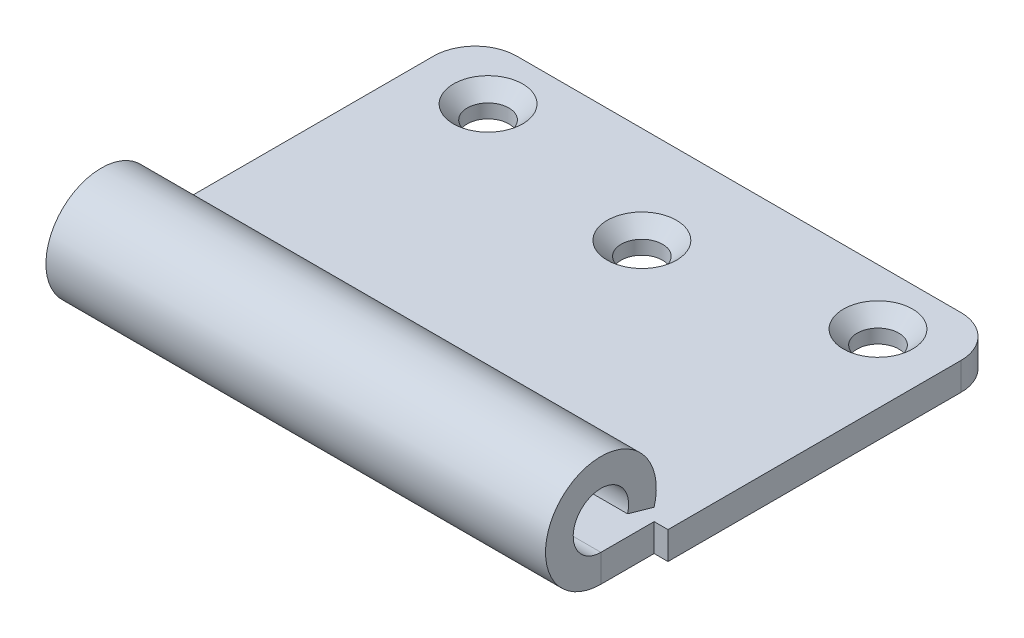
ISO-10303-21;
HEADER;
FILE_DESCRIPTION(('STEP AP214'),'2;1');
FILE_NAME('part.step','',(''),(''),'','','');
FILE_SCHEMA(('AUTOMOTIVE_DESIGN { 1 0 10303 214 1 1 1 1 }'));
ENDSEC;
DATA;
#1=APPLICATION_CONTEXT('core data for automotive mechanical design processes');
#2=APPLICATION_PROTOCOL_DEFINITION('international standard','automotive_design',2000,#1);
#3=PRODUCT_CONTEXT('',#1,'mechanical');
#4=PRODUCT('Part','Part','',(#3));
#5=PRODUCT_RELATED_PRODUCT_CATEGORY('part','',(#4));
#6=PRODUCT_DEFINITION_FORMATION('','',#4);
#7=PRODUCT_DEFINITION_CONTEXT('part definition',#1,'design');
#8=PRODUCT_DEFINITION('design','',#6,#7);
#9=PRODUCT_DEFINITION_SHAPE('','',#8);
#10=(LENGTH_UNIT() NAMED_UNIT(*) SI_UNIT(.MILLI.,.METRE.));
#11=(NAMED_UNIT(*) PLANE_ANGLE_UNIT() SI_UNIT($,.RADIAN.));
#12=(NAMED_UNIT(*) SI_UNIT($,.STERADIAN.) SOLID_ANGLE_UNIT());
#13=UNCERTAINTY_MEASURE_WITH_UNIT(LENGTH_MEASURE(1.E-05),#10,'distance_accuracy_value','');
#14=(GEOMETRIC_REPRESENTATION_CONTEXT(3) GLOBAL_UNCERTAINTY_ASSIGNED_CONTEXT((#13)) GLOBAL_UNIT_ASSIGNED_CONTEXT((#10,
#11,#12)) REPRESENTATION_CONTEXT('',''));
#15=CARTESIAN_POINT('',(0.,0.,0.));
#16=DIRECTION('',(0.,0.,1.));
#17=DIRECTION('',(1.,0.,0.));
#18=AXIS2_PLACEMENT_3D('',#15,#16,#17);
#19=CARTESIAN_POINT('',(3.65617324596296,3.44872528836599,27.6968267927588));
#20=DIRECTION('',(0.,0.961261695938317,-0.275637355817006));
#21=DIRECTION('',(1.,0.,0.));
#22=AXIS2_PLACEMENT_3D('',#19,#20,#21);
#23=PLANE('',#22);
#24=DIRECTION('',(1.,0.,0.));
#25=VECTOR('',#24,1.);
#26=CARTESIAN_POINT('',(22.696173245963,3.44872528836599,27.6968267927588));
#27=LINE('',#26,#25);
#28=CARTESIAN_POINT('',(-14.383826754037,3.44872528836599,27.6968267927588));
#29=VERTEX_POINT('',#28);
#30=CARTESIAN_POINT('',(21.696173245963,3.44872528836599,27.6968267927588));
#31=VERTEX_POINT('',#30);
#32=EDGE_CURVE('E144',#29,#31,#27,.T.);
#33=ORIENTED_EDGE('',*,*,#32,.F.);
#34=DIRECTION('',(0.,0.275637355817006,0.961261695938317));
#35=VECTOR('',#34,1.);
#36=CARTESIAN_POINT('',(-14.383826754037,3.44872528836599,27.6968267927588));
#37=LINE('',#36,#35);
#38=CARTESIAN_POINT('',(-14.383826754037,2.89745057673197,25.7743034008822));
#39=VERTEX_POINT('',#38);
#40=EDGE_CURVE('E130',#29,#39,#37,.F.);
#41=ORIENTED_EDGE('',*,*,#40,.T.);
#42=DIRECTION('',(1.,0.,0.));
#43=VECTOR('',#42,1.);
#44=CARTESIAN_POINT('',(22.696173245963,2.89745057673197,25.7743034008822));
#45=LINE('',#44,#43);
#46=CARTESIAN_POINT('',(21.696173245963,2.89745057673197,25.7743034008822));
#47=VERTEX_POINT('',#46);
#48=EDGE_CURVE('E142',#39,#47,#45,.T.);
#49=ORIENTED_EDGE('',*,*,#48,.T.);
#50=DIRECTION('',(0.,-0.275637355817006,-0.961261695938317));
#51=VECTOR('',#50,1.);
#52=CARTESIAN_POINT('',(21.696173245963,3.44872528836599,27.6968267927588));
#53=LINE('',#52,#51);
#54=EDGE_CURVE('E238',#47,#31,#53,.F.);
#55=ORIENTED_EDGE('',*,*,#54,.T.);
#56=EDGE_LOOP('',(#33,#41,#49,#55));
#57=FACE_BOUND('',#56,.T.);
#58=ADVANCED_FACE('F40',(#57),#23,.F.);
#59=CARTESIAN_POINT('',(22.696173245963,4.,29.6193501846355));
#60=DIRECTION('',(1.,0.,0.));
#61=DIRECTION('',(0.,-0.275637355817006,-0.961261695938317));
#62=AXIS2_PLACEMENT_3D('',#59,#60,#61);
#63=CYLINDRICAL_SURFACE('',#62,4.);
#64=ORIENTED_EDGE('',*,*,#48,.F.);
#65=CARTESIAN_POINT('',(-14.383826754037,4.,29.6193501846355));
#66=DIRECTION('',(-1.,0.,0.));
#67=DIRECTION('',(0.,0.,1.));
#68=AXIS2_PLACEMENT_3D('',#65,#66,#67);
#69=CIRCLE('',#68,4.);
#70=CARTESIAN_POINT('',(-14.383826754037,0.,29.6193501846355));
#71=VERTEX_POINT('',#70);
#72=EDGE_CURVE('E127',#71,#39,#69,.T.);
#73=ORIENTED_EDGE('',*,*,#72,.F.);
#74=DIRECTION('',(1.,0.,0.));
#75=VECTOR('',#74,1.);
#76=CARTESIAN_POINT('',(-15.383826754037,0.,29.6193501846355));
#77=LINE('',#76,#75);
#78=CARTESIAN_POINT('',(21.696173245963,0.,29.6193501846355));
#79=VERTEX_POINT('',#78);
#80=EDGE_CURVE('E159',#71,#79,#77,.T.);
#81=ORIENTED_EDGE('',*,*,#80,.T.);
#82=CARTESIAN_POINT('',(21.696173245963,4.,29.6193501846355));
#83=DIRECTION('',(1.,0.,0.));
#84=DIRECTION('',(0.,0.,-1.));
#85=AXIS2_PLACEMENT_3D('',#82,#83,#84);
#86=CIRCLE('',#85,4.);
#87=EDGE_CURVE('E150',#47,#79,#86,.T.);
#88=ORIENTED_EDGE('',*,*,#87,.F.);
#89=EDGE_LOOP('',(#64,#73,#81,#88));
#90=FACE_BOUND('',#89,.T.);
#91=ADVANCED_FACE('F148',(#90),#63,.T.);
#92=CARTESIAN_POINT('',(22.696173245963,4.,29.6193501846355));
#93=DIRECTION('',(1.,0.,0.));
#94=DIRECTION('',(0.,-0.275637355817006,-0.961261695938317));
#95=AXIS2_PLACEMENT_3D('',#92,#93,#94);
#96=CYLINDRICAL_SURFACE('',#95,2.);
#97=CARTESIAN_POINT('',(-14.383826754037,4.,29.6193501846355));
#98=DIRECTION('',(-1.,0.,0.));
#99=DIRECTION('',(0.,0.,1.));
#100=AXIS2_PLACEMENT_3D('',#97,#98,#99);
#101=CIRCLE('',#100,2.);
#102=CARTESIAN_POINT('',(-14.383826754037,2.,29.6193501846355));
#103=VERTEX_POINT('',#102);
#104=EDGE_CURVE('E55',#29,#103,#101,.F.);
#105=ORIENTED_EDGE('',*,*,#104,.F.);
#106=ORIENTED_EDGE('',*,*,#32,.T.);
#107=CARTESIAN_POINT('',(21.696173245963,4.,29.6193501846355));
#108=DIRECTION('',(1.,0.,0.));
#109=DIRECTION('',(0.,0.,-1.));
#110=AXIS2_PLACEMENT_3D('',#107,#108,#109);
#111=CIRCLE('',#110,2.);
#112=CARTESIAN_POINT('',(21.696173245963,2.,29.6193501846355));
#113=VERTEX_POINT('',#112);
#114=EDGE_CURVE('E224',#113,#31,#111,.F.);
#115=ORIENTED_EDGE('',*,*,#114,.F.);
#116=DIRECTION('',(1.,0.,0.));
#117=VECTOR('',#116,1.);
#118=CARTESIAN_POINT('',(19.696173245963,2.,29.6193501846355));
#119=LINE('',#118,#117);
#120=EDGE_CURVE('E61',#103,#113,#119,.T.);
#121=ORIENTED_EDGE('',*,*,#120,.F.);
#122=EDGE_LOOP('',(#105,#106,#115,#121));
#123=FACE_BOUND('',#122,.T.);
#124=ADVANCED_FACE('F306',(#123),#96,.F.);
#125=CARTESIAN_POINT('',(21.696173245963,4.,29.6193501846355));
#126=DIRECTION('',(1.,0.,0.));
#127=DIRECTION('',(0.,0.,-1.));
#128=AXIS2_PLACEMENT_3D('',#125,#126,#127);
#129=PLANE('',#128);
#130=DIRECTION('',(0.,0.,-1.));
#131=VECTOR('',#130,1.);
#132=CARTESIAN_POINT('',(21.6961732459629,2.,4.61935018463548));
#133=LINE('',#132,#131);
#134=CARTESIAN_POINT('',(21.696173245963,2.,25.7743034008822));
#135=VERTEX_POINT('',#134);
#136=EDGE_CURVE('E234',#113,#135,#133,.T.);
#137=ORIENTED_EDGE('',*,*,#136,.F.);
#138=DIRECTION('',(0.,-1.,0.));
#139=VECTOR('',#138,1.);
#140=CARTESIAN_POINT('',(21.696173245963,2.,29.6193501846355));
#141=LINE('',#140,#139);
#142=EDGE_CURVE('E48',#113,#79,#141,.T.);
#143=ORIENTED_EDGE('',*,*,#142,.T.);
#144=DIRECTION('',(0.,0.,-1.));
#145=VECTOR('',#144,1.);
#146=CARTESIAN_POINT('',(21.696173245963,0.,25.7743034008822));
#147=LINE('',#146,#145);
#148=CARTESIAN_POINT('',(21.696173245963,0.,25.7743034008822));
#149=VERTEX_POINT('',#148);
#150=EDGE_CURVE('E232',#79,#149,#147,.T.);
#151=ORIENTED_EDGE('',*,*,#150,.T.);
#152=DIRECTION('',(0.,1.,0.));
#153=VECTOR('',#152,1.);
#154=CARTESIAN_POINT('',(21.696173245963,2.89745057673197,25.7743034008822));
#155=LINE('',#154,#153);
#156=EDGE_CURVE('E246',#149,#135,#155,.T.);
#157=ORIENTED_EDGE('',*,*,#156,.T.);
#158=EDGE_LOOP('',(#137,#143,#151,#157));
#159=FACE_BOUND('',#158,.T.);
#160=ADVANCED_FACE('F229',(#159),#129,.T.);
#161=CARTESIAN_POINT('',(-12.383826754037,0.,4.61935018463549));
#162=DIRECTION('',(0.,1.,0.));
#163=DIRECTION('',(0.,0.,1.));
#164=AXIS2_PLACEMENT_3D('',#161,#162,#163);
#165=CYLINDRICAL_SURFACE('',#164,3.);
#166=DIRECTION('',(0.,-1.,0.));
#167=VECTOR('',#166,1.);
#168=CARTESIAN_POINT('',(-15.383826754037,0.,4.61935018463551));
#169=LINE('',#168,#167);
#170=CARTESIAN_POINT('',(-15.383826754037,2.,4.61935018463551));
#171=VERTEX_POINT('',#170);
#172=CARTESIAN_POINT('',(-15.383826754037,0.,4.61935018463551));
#173=VERTEX_POINT('',#172);
#174=EDGE_CURVE('E204',#171,#173,#169,.T.);
#175=ORIENTED_EDGE('',*,*,#174,.F.);
#176=CARTESIAN_POINT('',(-12.383826754037,2.,4.61935018463549));
#177=DIRECTION('',(0.,1.,0.));
#178=DIRECTION('',(0.,0.,1.));
#179=AXIS2_PLACEMENT_3D('',#176,#177,#178);
#180=CIRCLE('',#179,3.);
#181=CARTESIAN_POINT('',(-12.383826754037,2.,1.61935018463549));
#182=VERTEX_POINT('',#181);
#183=EDGE_CURVE('E193',#182,#171,#180,.T.);
#184=ORIENTED_EDGE('',*,*,#183,.F.);
#185=DIRECTION('',(0.,-1.,0.));
#186=VECTOR('',#185,1.);
#187=CARTESIAN_POINT('',(-12.383826754037,0.,1.61935018463549));
#188=LINE('',#187,#186);
#189=CARTESIAN_POINT('',(-12.383826754037,0.,1.61935018463549));
#190=VERTEX_POINT('',#189);
#191=EDGE_CURVE('E202',#182,#190,#188,.T.);
#192=ORIENTED_EDGE('',*,*,#191,.T.);
#193=CARTESIAN_POINT('',(-12.383826754037,0.,4.61935018463549));
#194=DIRECTION('',(0.,1.,0.));
#195=DIRECTION('',(0.,0.,1.));
#196=AXIS2_PLACEMENT_3D('',#193,#194,#195);
#197=CIRCLE('',#196,3.);
#198=EDGE_CURVE('E165',#190,#173,#197,.T.);
#199=ORIENTED_EDGE('',*,*,#198,.T.);
#200=EDGE_LOOP('',(#175,#184,#192,#199));
#201=FACE_BOUND('',#200,.T.);
#202=ADVANCED_FACE('F274',(#201),#165,.T.);
#203=CARTESIAN_POINT('',(-12.383826754037,0.,1.61935018463549));
#204=DIRECTION('',(0.,0.,-1.));
#205=DIRECTION('',(-1.,0.,0.));
#206=AXIS2_PLACEMENT_3D('',#203,#204,#205);
#207=PLANE('',#206);
#208=ORIENTED_EDGE('',*,*,#191,.F.);
#209=DIRECTION('',(1.,0.,0.));
#210=VECTOR('',#209,1.);
#211=CARTESIAN_POINT('',(19.696173245963,2.,1.61935018463548));
#212=LINE('',#211,#210);
#213=CARTESIAN_POINT('',(19.6961732459629,2.,1.61935018463548));
#214=VERTEX_POINT('',#213);
#215=EDGE_CURVE('E190',#214,#182,#212,.F.);
#216=ORIENTED_EDGE('',*,*,#215,.F.);
#217=DIRECTION('',(0.,-1.,0.));
#218=VECTOR('',#217,1.);
#219=CARTESIAN_POINT('',(19.6961732459629,0.,1.61935018463548));
#220=LINE('',#219,#218);
#221=CARTESIAN_POINT('',(19.6961732459629,0.,1.61935018463548));
#222=VERTEX_POINT('',#221);
#223=EDGE_CURVE('E200',#214,#222,#220,.T.);
#224=ORIENTED_EDGE('',*,*,#223,.T.);
#225=DIRECTION('',(-1.,0.,0.));
#226=VECTOR('',#225,1.);
#227=CARTESIAN_POINT('',(-12.383826754037,0.,1.61935018463549));
#228=LINE('',#227,#226);
#229=EDGE_CURVE('E168',#222,#190,#228,.T.);
#230=ORIENTED_EDGE('',*,*,#229,.T.);
#231=EDGE_LOOP('',(#208,#216,#224,#230));
#232=FACE_BOUND('',#231,.T.);
#233=ADVANCED_FACE('F270',(#232),#207,.T.);
#234=CARTESIAN_POINT('',(19.696173245963,0.,4.61935018463548));
#235=DIRECTION('',(0.,1.,0.));
#236=DIRECTION('',(0.,0.,1.));
#237=AXIS2_PLACEMENT_3D('',#234,#235,#236);
#238=CYLINDRICAL_SURFACE('',#237,3.);
#239=ORIENTED_EDGE('',*,*,#223,.F.);
#240=CARTESIAN_POINT('',(19.696173245963,2.,4.61935018463548));
#241=DIRECTION('',(0.,1.,0.));
#242=DIRECTION('',(0.,0.,1.));
#243=AXIS2_PLACEMENT_3D('',#240,#241,#242);
#244=CIRCLE('',#243,3.);
#245=CARTESIAN_POINT('',(22.696173245963,2.,4.6193501846355));
#246=VERTEX_POINT('',#245);
#247=EDGE_CURVE('E187',#246,#214,#244,.T.);
#248=ORIENTED_EDGE('',*,*,#247,.F.);
#249=DIRECTION('',(0.,-1.,0.));
#250=VECTOR('',#249,1.);
#251=CARTESIAN_POINT('',(22.696173245963,0.,4.6193501846355));
#252=LINE('',#251,#250);
#253=CARTESIAN_POINT('',(22.696173245963,0.,4.6193501846355));
#254=VERTEX_POINT('',#253);
#255=EDGE_CURVE('E184',#246,#254,#252,.T.);
#256=ORIENTED_EDGE('',*,*,#255,.T.);
#257=CARTESIAN_POINT('',(19.696173245963,0.,4.61935018463548));
#258=DIRECTION('',(0.,1.,0.));
#259=DIRECTION('',(0.,0.,1.));
#260=AXIS2_PLACEMENT_3D('',#257,#258,#259);
#261=CIRCLE('',#260,3.);
#262=EDGE_CURVE('E171',#254,#222,#261,.T.);
#263=ORIENTED_EDGE('',*,*,#262,.T.);
#264=EDGE_LOOP('',(#239,#248,#256,#263));
#265=FACE_BOUND('',#264,.T.);
#266=ADVANCED_FACE('F266',(#265),#238,.T.);
#267=CARTESIAN_POINT('',(22.696173245963,0.,4.6193501846355));
#268=DIRECTION('',(1.,0.,0.));
#269=DIRECTION('',(0.,0.,-1.));
#270=AXIS2_PLACEMENT_3D('',#267,#268,#269);
#271=PLANE('',#270);
#272=DIRECTION('',(0.,1.,0.));
#273=VECTOR('',#272,1.);
#274=CARTESIAN_POINT('',(22.696173245963,2.89745057673197,25.7743034008822));
#275=LINE('',#274,#273);
#276=CARTESIAN_POINT('',(22.696173245963,0.,25.7743034008822));
#277=VERTEX_POINT('',#276);
#278=CARTESIAN_POINT('',(22.696173245963,2.,25.7743034008822));
#279=VERTEX_POINT('',#278);
#280=EDGE_CURVE('E145',#277,#279,#275,.T.);
#281=ORIENTED_EDGE('',*,*,#280,.F.);
#282=DIRECTION('',(0.,0.,-1.));
#283=VECTOR('',#282,1.);
#284=CARTESIAN_POINT('',(22.696173245963,0.,4.6193501846355));
#285=LINE('',#284,#283);
#286=EDGE_CURVE('E174',#277,#254,#285,.T.);
#287=ORIENTED_EDGE('',*,*,#286,.T.);
#288=ORIENTED_EDGE('',*,*,#255,.F.);
#289=DIRECTION('',(0.,0.,1.));
#290=VECTOR('',#289,1.);
#291=CARTESIAN_POINT('',(22.696173245963,2.,4.61935018463548));
#292=LINE('',#291,#290);
#293=EDGE_CURVE('E162',#279,#246,#292,.F.);
#294=ORIENTED_EDGE('',*,*,#293,.F.);
#295=EDGE_LOOP('',(#281,#287,#288,#294));
#296=FACE_BOUND('',#295,.T.);
#297=ADVANCED_FACE('F262',(#296),#271,.T.);
#298=CARTESIAN_POINT('',(-15.383826754037,0.,12.1160603566887));
#299=DIRECTION('',(-1.,0.,0.));
#300=DIRECTION('',(0.,0.,1.));
#301=AXIS2_PLACEMENT_3D('',#298,#299,#300);
#302=PLANE('',#301);
#303=DIRECTION('',(0.,-1.,0.));
#304=VECTOR('',#303,1.);
#305=CARTESIAN_POINT('',(-15.383826754037,2.89745057673197,25.7743034008822));
#306=LINE('',#305,#304);
#307=CARTESIAN_POINT('',(-15.383826754037,2.,25.7743034008822));
#308=VERTEX_POINT('',#307);
#309=CARTESIAN_POINT('',(-15.383826754037,0.,25.7743034008822));
#310=VERTEX_POINT('',#309);
#311=EDGE_CURVE('E137',#308,#310,#306,.T.);
#312=ORIENTED_EDGE('',*,*,#311,.F.);
#313=DIRECTION('',(0.,0.,1.));
#314=VECTOR('',#313,1.);
#315=CARTESIAN_POINT('',(-15.383826754037,2.,4.61935018463548));
#316=LINE('',#315,#314);
#317=EDGE_CURVE('E152',#171,#308,#316,.T.);
#318=ORIENTED_EDGE('',*,*,#317,.F.);
#319=ORIENTED_EDGE('',*,*,#174,.T.);
#320=DIRECTION('',(0.,0.,1.));
#321=VECTOR('',#320,1.);
#322=CARTESIAN_POINT('',(-15.383826754037,0.,12.1160603566887));
#323=LINE('',#322,#321);
#324=EDGE_CURVE('E161',#173,#310,#323,.T.);
#325=ORIENTED_EDGE('',*,*,#324,.T.);
#326=EDGE_LOOP('',(#312,#318,#319,#325));
#327=FACE_BOUND('',#326,.T.);
#328=ADVANCED_FACE('F281',(#327),#302,.T.);
#329=CARTESIAN_POINT('',(17.7374344676116,0.,5.64654971374041));
#330=DIRECTION('',(0.,1.,0.));
#331=DIRECTION('',(0.,0.,1.));
#332=AXIS2_PLACEMENT_3D('',#329,#330,#331);
#333=CYLINDRICAL_SURFACE('',#332,1.5);
#334=CARTESIAN_POINT('',(17.7374344676116,1.00000000000001,5.64654971374041));
#335=DIRECTION('',(0.,1.,0.));
#336=DIRECTION('',(0.,0.,1.));
#337=AXIS2_PLACEMENT_3D('',#334,#335,#336);
#338=CIRCLE('',#337,1.5);
#339=CARTESIAN_POINT('',(17.7374344676116,1.00000000000001,7.14654971374041));
#340=VERTEX_POINT('',#339);
#341=EDGE_CURVE('E206',#340,#340,#338,.T.);
#342=ORIENTED_EDGE('',*,*,#341,.T.);
#343=EDGE_LOOP('',(#342));
#344=FACE_BOUND('',#343,.T.);
#345=CARTESIAN_POINT('',(17.7374344676116,0.,5.64654971374041));
#346=DIRECTION('',(0.,1.,0.));
#347=DIRECTION('',(0.,0.,-1.));
#348=AXIS2_PLACEMENT_3D('',#345,#346,#347);
#349=CIRCLE('',#348,1.5);
#350=CARTESIAN_POINT('',(17.7374344676116,0.,4.14654971374041));
#351=VERTEX_POINT('',#350);
#352=EDGE_CURVE('E176',#351,#351,#349,.T.);
#353=ORIENTED_EDGE('',*,*,#352,.F.);
#354=EDGE_LOOP('',(#353));
#355=FACE_BOUND('',#354,.T.);
#356=ADVANCED_FACE('F326',(#344,#355),#333,.F.);
#357=CARTESIAN_POINT('',(3.65617324596296,0.,8.61935018463548));
#358=DIRECTION('',(0.,1.,0.));
#359=DIRECTION('',(0.,0.,1.));
#360=AXIS2_PLACEMENT_3D('',#357,#358,#359);
#361=CYLINDRICAL_SURFACE('',#360,1.5);
#362=CARTESIAN_POINT('',(3.65617324596296,1.00000000000001,8.61935018463548));
#363=DIRECTION('',(0.,1.,0.));
#364=DIRECTION('',(0.,0.,1.));
#365=AXIS2_PLACEMENT_3D('',#362,#363,#364);
#366=CIRCLE('',#365,1.5);
#367=CARTESIAN_POINT('',(3.65617324596296,1.00000000000001,10.1193501846355));
#368=VERTEX_POINT('',#367);
#369=EDGE_CURVE('E218',#368,#368,#366,.T.);
#370=ORIENTED_EDGE('',*,*,#369,.T.);
#371=EDGE_LOOP('',(#370));
#372=FACE_BOUND('',#371,.T.);
#373=CARTESIAN_POINT('',(3.65617324596296,0.,8.61935018463548));
#374=DIRECTION('',(0.,1.,0.));
#375=DIRECTION('',(0.,0.,1.));
#376=AXIS2_PLACEMENT_3D('',#373,#374,#375);
#377=CIRCLE('',#376,1.5);
#378=CARTESIAN_POINT('',(3.65617324596296,0.,10.1193501846355));
#379=VERTEX_POINT('',#378);
#380=EDGE_CURVE('E179',#379,#379,#377,.T.);
#381=ORIENTED_EDGE('',*,*,#380,.F.);
#382=EDGE_LOOP('',(#381));
#383=FACE_BOUND('',#382,.T.);
#384=ADVANCED_FACE('F329',(#372,#383),#361,.F.);
#385=CARTESIAN_POINT('',(-10.4250879756856,0.,5.64654971374041));
#386=DIRECTION('',(0.,1.,0.));
#387=DIRECTION('',(0.,0.,1.));
#388=AXIS2_PLACEMENT_3D('',#385,#386,#387);
#389=CYLINDRICAL_SURFACE('',#388,1.5);
#390=CARTESIAN_POINT('',(-10.4250879756856,1.00000000000001,5.64654971374041));
#391=DIRECTION('',(0.,1.,0.));
#392=DIRECTION('',(0.,0.,1.));
#393=AXIS2_PLACEMENT_3D('',#390,#391,#392);
#394=CIRCLE('',#393,1.5);
#395=CARTESIAN_POINT('',(-10.4250879756856,1.00000000000001,7.14654971374041));
#396=VERTEX_POINT('',#395);
#397=EDGE_CURVE('E221',#396,#396,#394,.T.);
#398=ORIENTED_EDGE('',*,*,#397,.T.);
#399=EDGE_LOOP('',(#398));
#400=FACE_BOUND('',#399,.T.);
#401=CARTESIAN_POINT('',(-10.4250879756856,0.,5.64654971374041));
#402=DIRECTION('',(0.,1.,0.));
#403=DIRECTION('',(0.,0.,1.));
#404=AXIS2_PLACEMENT_3D('',#401,#402,#403);
#405=CIRCLE('',#404,1.5);
#406=CARTESIAN_POINT('',(-10.4250879756856,0.,7.14654971374041));
#407=VERTEX_POINT('',#406);
#408=EDGE_CURVE('E182',#407,#407,#405,.T.);
#409=ORIENTED_EDGE('',*,*,#408,.F.);
#410=EDGE_LOOP('',(#409));
#411=FACE_BOUND('',#410,.T.);
#412=ADVANCED_FACE('F312',(#400,#411),#389,.F.);
#413=CARTESIAN_POINT('',(19.696173245963,0.,4.61935018463548));
#414=DIRECTION('',(0.,1.,0.));
#415=DIRECTION('',(0.,0.,1.));
#416=AXIS2_PLACEMENT_3D('',#413,#414,#415);
#417=PLANE('',#416);
#418=DIRECTION('',(0.,0.,1.));
#419=VECTOR('',#418,1.);
#420=CARTESIAN_POINT('',(-14.383826754037,0.,25.7743034008822));
#421=LINE('',#420,#419);
#422=CARTESIAN_POINT('',(-14.383826754037,0.,25.7743034008822));
#423=VERTEX_POINT('',#422);
#424=EDGE_CURVE('E132',#423,#71,#421,.T.);
#425=ORIENTED_EDGE('',*,*,#424,.F.);
#426=DIRECTION('',(-1.,0.,0.));
#427=VECTOR('',#426,1.);
#428=CARTESIAN_POINT('',(-14.383826754037,0.,25.7743034008822));
#429=LINE('',#428,#427);
#430=EDGE_CURVE('E278',#423,#310,#429,.T.);
#431=ORIENTED_EDGE('',*,*,#430,.T.);
#432=ORIENTED_EDGE('',*,*,#324,.F.);
#433=ORIENTED_EDGE('',*,*,#198,.F.);
#434=ORIENTED_EDGE('',*,*,#229,.F.);
#435=ORIENTED_EDGE('',*,*,#262,.F.);
#436=ORIENTED_EDGE('',*,*,#286,.F.);
#437=DIRECTION('',(1.,0.,0.));
#438=VECTOR('',#437,1.);
#439=CARTESIAN_POINT('',(21.696173245963,0.,25.7743034008822));
#440=LINE('',#439,#438);
#441=EDGE_CURVE('E245',#149,#277,#440,.T.);
#442=ORIENTED_EDGE('',*,*,#441,.F.);
#443=ORIENTED_EDGE('',*,*,#150,.F.);
#444=ORIENTED_EDGE('',*,*,#80,.F.);
#445=EDGE_LOOP('',(#425,#431,#432,#433,#434,#435,#436,#442,#443,#444));
#446=FACE_BOUND('',#445,.T.);
#447=ORIENTED_EDGE('',*,*,#352,.T.);
#448=EDGE_LOOP('',(#447));
#449=FACE_BOUND('',#448,.T.);
#450=ORIENTED_EDGE('',*,*,#380,.T.);
#451=EDGE_LOOP('',(#450));
#452=FACE_BOUND('',#451,.T.);
#453=ORIENTED_EDGE('',*,*,#408,.T.);
#454=EDGE_LOOP('',(#453));
#455=FACE_BOUND('',#454,.T.);
#456=ADVANCED_FACE('F242',(#446,#449,#452,#455),#417,.F.);
#457=CARTESIAN_POINT('',(19.696173245963,2.,4.61935018463548));
#458=DIRECTION('',(0.,1.,0.));
#459=DIRECTION('',(0.,0.,1.));
#460=AXIS2_PLACEMENT_3D('',#457,#458,#459);
#461=PLANE('',#460);
#462=DIRECTION('',(-1.,0.,0.));
#463=VECTOR('',#462,1.);
#464=CARTESIAN_POINT('',(19.696173245963,2.,25.7743034008822));
#465=LINE('',#464,#463);
#466=CARTESIAN_POINT('',(-14.383826754037,2.,25.7743034008822));
#467=VERTEX_POINT('',#466);
#468=EDGE_CURVE('E283',#467,#308,#465,.T.);
#469=ORIENTED_EDGE('',*,*,#468,.F.);
#470=DIRECTION('',(0.,0.,1.));
#471=VECTOR('',#470,1.);
#472=CARTESIAN_POINT('',(-14.383826754037,2.,4.61935018463549));
#473=LINE('',#472,#471);
#474=EDGE_CURVE('E12',#467,#103,#473,.T.);
#475=ORIENTED_EDGE('',*,*,#474,.T.);
#476=ORIENTED_EDGE('',*,*,#120,.T.);
#477=ORIENTED_EDGE('',*,*,#136,.T.);
#478=DIRECTION('',(-1.,0.,0.));
#479=VECTOR('',#478,1.);
#480=CARTESIAN_POINT('',(19.696173245963,2.,25.7743034008822));
#481=LINE('',#480,#479);
#482=EDGE_CURVE('E154',#279,#135,#481,.T.);
#483=ORIENTED_EDGE('',*,*,#482,.F.);
#484=ORIENTED_EDGE('',*,*,#293,.T.);
#485=ORIENTED_EDGE('',*,*,#247,.T.);
#486=ORIENTED_EDGE('',*,*,#215,.T.);
#487=ORIENTED_EDGE('',*,*,#183,.T.);
#488=ORIENTED_EDGE('',*,*,#317,.T.);
#489=EDGE_LOOP('',(#469,#475,#476,#477,#483,#484,#485,#486,#487,#488));
#490=FACE_BOUND('',#489,.T.);
#491=CARTESIAN_POINT('',(17.7374344676116,2.,5.64654971374041));
#492=DIRECTION('',(0.,1.,0.));
#493=DIRECTION('',(0.,0.,1.));
#494=AXIS2_PLACEMENT_3D('',#491,#492,#493);
#495=CIRCLE('',#494,2.49999999999999);
#496=CARTESIAN_POINT('',(17.7374344676116,2.,8.1465497137404));
#497=VERTEX_POINT('',#496);
#498=EDGE_CURVE('E215',#497,#497,#495,.F.);
#499=ORIENTED_EDGE('',*,*,#498,.T.);
#500=EDGE_LOOP('',(#499));
#501=FACE_BOUND('',#500,.T.);
#502=CARTESIAN_POINT('',(3.65617324596296,2.,8.61935018463548));
#503=DIRECTION('',(0.,1.,0.));
#504=DIRECTION('',(0.,0.,1.));
#505=AXIS2_PLACEMENT_3D('',#502,#503,#504);
#506=CIRCLE('',#505,2.49999999999999);
#507=CARTESIAN_POINT('',(3.65617324596296,2.,11.1193501846355));
#508=VERTEX_POINT('',#507);
#509=EDGE_CURVE('E212',#508,#508,#506,.F.);
#510=ORIENTED_EDGE('',*,*,#509,.T.);
#511=EDGE_LOOP('',(#510));
#512=FACE_BOUND('',#511,.T.);
#513=CARTESIAN_POINT('',(-10.4250879756856,2.,5.64654971374041));
#514=DIRECTION('',(0.,1.,0.));
#515=DIRECTION('',(0.,0.,1.));
#516=AXIS2_PLACEMENT_3D('',#513,#514,#515);
#517=CIRCLE('',#516,2.49999999999999);
#518=CARTESIAN_POINT('',(-10.4250879756856,2.,8.1465497137404));
#519=VERTEX_POINT('',#518);
#520=EDGE_CURVE('E209',#519,#519,#517,.F.);
#521=ORIENTED_EDGE('',*,*,#520,.T.);
#522=EDGE_LOOP('',(#521));
#523=FACE_BOUND('',#522,.T.);
#524=ADVANCED_FACE('F258',(#490,#501,#512,#523),#461,.T.);
#525=CARTESIAN_POINT('',(17.7374344676116,1.00000000000001,5.64654971374041));
#526=DIRECTION('',(0.,1.,0.));
#527=DIRECTION('',(0.,0.,1.));
#528=AXIS2_PLACEMENT_3D('',#525,#526,#527);
#529=CONICAL_SURFACE('',#528,1.5,0.785398163397449);
#530=ORIENTED_EDGE('',*,*,#498,.F.);
#531=EDGE_LOOP('',(#530));
#532=FACE_BOUND('',#531,.T.);
#533=ORIENTED_EDGE('',*,*,#341,.F.);
#534=EDGE_LOOP('',(#533));
#535=FACE_BOUND('',#534,.T.);
#536=ADVANCED_FACE('F315',(#532,#535),#529,.F.);
#537=CARTESIAN_POINT('',(3.65617324596296,1.00000000000001,8.61935018463548));
#538=DIRECTION('',(0.,1.,0.));
#539=DIRECTION('',(0.,0.,1.));
#540=AXIS2_PLACEMENT_3D('',#537,#538,#539);
#541=CONICAL_SURFACE('',#540,1.5,0.785398163397449);
#542=ORIENTED_EDGE('',*,*,#509,.F.);
#543=EDGE_LOOP('',(#542));
#544=FACE_BOUND('',#543,.T.);
#545=ORIENTED_EDGE('',*,*,#369,.F.);
#546=EDGE_LOOP('',(#545));
#547=FACE_BOUND('',#546,.T.);
#548=ADVANCED_FACE('F338',(#544,#547),#541,.F.);
#549=CARTESIAN_POINT('',(-10.4250879756856,1.00000000000001,5.64654971374041));
#550=DIRECTION('',(0.,1.,0.));
#551=DIRECTION('',(0.,0.,1.));
#552=AXIS2_PLACEMENT_3D('',#549,#550,#551);
#553=CONICAL_SURFACE('',#552,1.5,0.785398163397449);
#554=ORIENTED_EDGE('',*,*,#520,.F.);
#555=EDGE_LOOP('',(#554));
#556=FACE_BOUND('',#555,.T.);
#557=ORIENTED_EDGE('',*,*,#397,.F.);
#558=EDGE_LOOP('',(#557));
#559=FACE_BOUND('',#558,.T.);
#560=ADVANCED_FACE('F42',(#556,#559),#553,.F.);
#561=CARTESIAN_POINT('',(21.696173245963,2.89745057673197,25.7743034008822));
#562=DIRECTION('',(0.,0.,-1.));
#563=DIRECTION('',(-1.,0.,0.));
#564=AXIS2_PLACEMENT_3D('',#561,#562,#563);
#565=PLANE('',#564);
#566=ORIENTED_EDGE('',*,*,#482,.T.);
#567=ORIENTED_EDGE('',*,*,#156,.F.);
#568=ORIENTED_EDGE('',*,*,#441,.T.);
#569=ORIENTED_EDGE('',*,*,#280,.T.);
#570=EDGE_LOOP('',(#566,#567,#568,#569));
#571=FACE_BOUND('',#570,.T.);
#572=ADVANCED_FACE('F254',(#571),#565,.F.);
#573=ORIENTED_EDGE('',*,*,#142,.F.);
#574=ORIENTED_EDGE('',*,*,#114,.T.);
#575=ORIENTED_EDGE('',*,*,#54,.F.);
#576=ORIENTED_EDGE('',*,*,#87,.T.);
#577=EDGE_LOOP('',(#573,#574,#575,#576));
#578=FACE_BOUND('',#577,.T.);
#579=ADVANCED_FACE('F237',(#578),#129,.T.);
#580=CARTESIAN_POINT('',(-14.383826754037,2.89745057673197,25.7743034008822));
#581=DIRECTION('',(0.,0.,-1.));
#582=DIRECTION('',(-1.,0.,0.));
#583=AXIS2_PLACEMENT_3D('',#580,#581,#582);
#584=PLANE('',#583);
#585=ORIENTED_EDGE('',*,*,#468,.T.);
#586=ORIENTED_EDGE('',*,*,#311,.T.);
#587=ORIENTED_EDGE('',*,*,#430,.F.);
#588=DIRECTION('',(0.,-1.,0.));
#589=VECTOR('',#588,1.);
#590=CARTESIAN_POINT('',(-14.383826754037,2.89745057673197,25.7743034008822));
#591=LINE('',#590,#589);
#592=EDGE_CURVE('E136',#467,#423,#591,.T.);
#593=ORIENTED_EDGE('',*,*,#592,.F.);
#594=EDGE_LOOP('',(#585,#586,#587,#593));
#595=FACE_BOUND('',#594,.T.);
#596=ADVANCED_FACE('F292',(#595),#584,.F.);
#597=CARTESIAN_POINT('',(-14.383826754037,4.,29.6193501846355));
#598=DIRECTION('',(-1.,0.,0.));
#599=DIRECTION('',(0.,0.,1.));
#600=AXIS2_PLACEMENT_3D('',#597,#598,#599);
#601=PLANE('',#600);
#602=ORIENTED_EDGE('',*,*,#104,.T.);
#603=ORIENTED_EDGE('',*,*,#474,.F.);
#604=ORIENTED_EDGE('',*,*,#592,.T.);
#605=ORIENTED_EDGE('',*,*,#424,.T.);
#606=ORIENTED_EDGE('',*,*,#72,.T.);
#607=ORIENTED_EDGE('',*,*,#40,.F.);
#608=EDGE_LOOP('',(#602,#603,#604,#605,#606,#607));
#609=FACE_BOUND('',#608,.T.);
#610=ADVANCED_FACE('F129',(#609),#601,.T.);
#611=CLOSED_SHELL('',(#58,#91,#124,#160,#202,#233,#266,#297,#328,#356,#384,#412,#456,#524,#536,
#548,#560,#572,#579,#596,#610));
#612=MANIFOLD_SOLID_BREP('B2',#611);
#613=ADVANCED_BREP_SHAPE_REPRESENTATION('',(#18,#612),#14);
#614=SHAPE_DEFINITION_REPRESENTATION(#9,#613);
ENDSEC;
END-ISO-10303-21;
